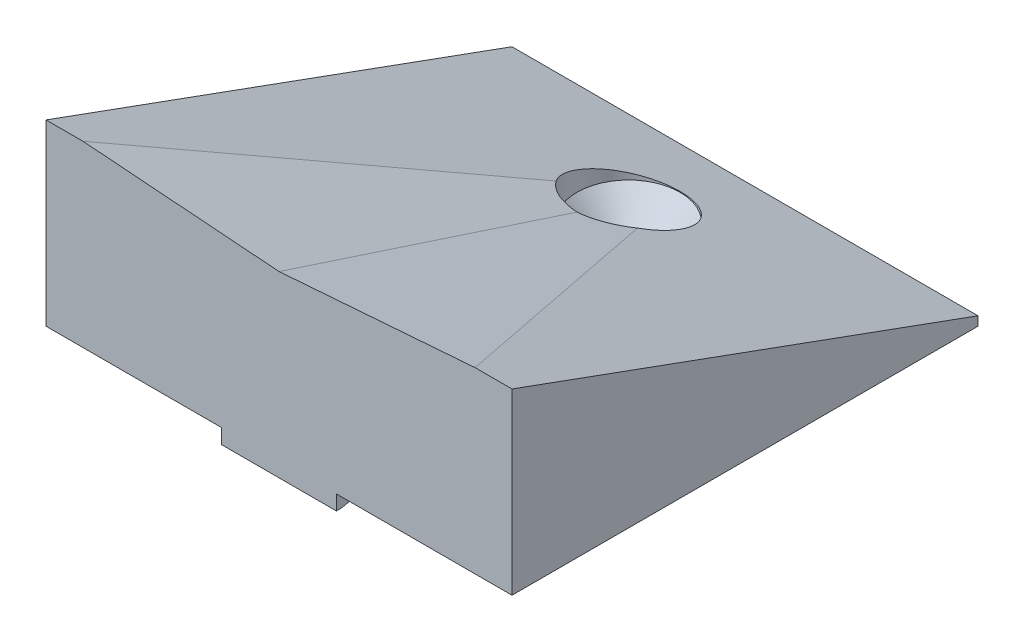
ISO-10303-21;
HEADER;
FILE_DESCRIPTION(('STEP AP214'),'2;1');
FILE_NAME('part.step','',(''),(''),'','','');
FILE_SCHEMA(('AUTOMOTIVE_DESIGN { 1 0 10303 214 1 1 1 1 }'));
ENDSEC;
DATA;
#1=APPLICATION_CONTEXT('core data for automotive mechanical design processes');
#2=APPLICATION_PROTOCOL_DEFINITION('international standard','automotive_design',2000,#1);
#3=PRODUCT_CONTEXT('',#1,'mechanical');
#4=PRODUCT('Part','Part','',(#3));
#5=PRODUCT_RELATED_PRODUCT_CATEGORY('part','',(#4));
#6=PRODUCT_DEFINITION_FORMATION('','',#4);
#7=PRODUCT_DEFINITION_CONTEXT('part definition',#1,'design');
#8=PRODUCT_DEFINITION('design','',#6,#7);
#9=PRODUCT_DEFINITION_SHAPE('','',#8);
#10=(LENGTH_UNIT() NAMED_UNIT(*) SI_UNIT(.MILLI.,.METRE.));
#11=(NAMED_UNIT(*) PLANE_ANGLE_UNIT() SI_UNIT($,.RADIAN.));
#12=(NAMED_UNIT(*) SI_UNIT($,.STERADIAN.) SOLID_ANGLE_UNIT());
#13=UNCERTAINTY_MEASURE_WITH_UNIT(LENGTH_MEASURE(1.E-05),#10,'distance_accuracy_value','');
#14=(GEOMETRIC_REPRESENTATION_CONTEXT(3) GLOBAL_UNCERTAINTY_ASSIGNED_CONTEXT((#13)) GLOBAL_UNIT_ASSIGNED_CONTEXT((#10,
#11,#12)) REPRESENTATION_CONTEXT('',''));
#15=CARTESIAN_POINT('',(0.,0.,0.));
#16=DIRECTION('',(0.,0.,1.));
#17=DIRECTION('',(1.,0.,0.));
#18=AXIS2_PLACEMENT_3D('',#15,#16,#17);
#19=CARTESIAN_POINT('',(16.,0.,0.));
#20=DIRECTION('',(0.,1.,0.));
#21=DIRECTION('',(0.,0.,1.));
#22=AXIS2_PLACEMENT_3D('',#19,#20,#21);
#23=PLANE('',#22);
#24=CARTESIAN_POINT('',(0.,0.,-24.0000000000002));
#25=DIRECTION('',(0.,1.,0.));
#26=DIRECTION('',(0.,0.,1.));
#27=AXIS2_PLACEMENT_3D('',#24,#25,#26);
#28=CIRCLE('',#27,1.89865);
#29=CARTESIAN_POINT('',(0.,0.,-22.1013500000002));
#30=VERTEX_POINT('',#29);
#31=EDGE_CURVE('E203',#30,#30,#28,.T.);
#32=ORIENTED_EDGE('',*,*,#31,.T.);
#33=EDGE_LOOP('',(#32));
#34=FACE_BOUND('',#33,.T.);
#35=CARTESIAN_POINT('',(8.,0.,-16.0000000000002));
#36=DIRECTION('',(0.,1.,0.));
#37=DIRECTION('',(0.,0.,1.));
#38=AXIS2_PLACEMENT_3D('',#35,#36,#37);
#39=CIRCLE('',#38,1.7992);
#40=CARTESIAN_POINT('',(8.,0.,-14.2008000000002));
#41=VERTEX_POINT('',#40);
#42=EDGE_CURVE('E143',#41,#41,#39,.F.);
#43=ORIENTED_EDGE('',*,*,#42,.F.);
#44=EDGE_LOOP('',(#43));
#45=FACE_BOUND('',#44,.T.);
#46=CARTESIAN_POINT('',(0.,0.,-16.0000000000002));
#47=DIRECTION('',(0.,1.,0.));
#48=DIRECTION('',(0.,0.,1.));
#49=AXIS2_PLACEMENT_3D('',#46,#47,#48);
#50=CIRCLE('',#49,3.9492);
#51=CARTESIAN_POINT('',(0.,0.,-12.0508000000002));
#52=VERTEX_POINT('',#51);
#53=EDGE_CURVE('E146',#52,#52,#50,.F.);
#54=ORIENTED_EDGE('',*,*,#53,.F.);
#55=EDGE_LOOP('',(#54));
#56=FACE_BOUND('',#55,.T.);
#57=CARTESIAN_POINT('',(-8.,0.,-16.0000000000002));
#58=DIRECTION('',(0.,1.,0.));
#59=DIRECTION('',(0.,0.,1.));
#60=AXIS2_PLACEMENT_3D('',#57,#58,#59);
#61=CIRCLE('',#60,1.7992);
#62=CARTESIAN_POINT('',(-8.,0.,-14.2008000000002));
#63=VERTEX_POINT('',#62);
#64=EDGE_CURVE('E149',#63,#63,#61,.F.);
#65=ORIENTED_EDGE('',*,*,#64,.F.);
#66=EDGE_LOOP('',(#65));
#67=FACE_BOUND('',#66,.T.);
#68=CARTESIAN_POINT('',(0.,0.,-8.00000000000024));
#69=DIRECTION('',(0.,1.,0.));
#70=DIRECTION('',(0.,0.,1.));
#71=AXIS2_PLACEMENT_3D('',#68,#69,#70);
#72=CIRCLE('',#71,1.7992);
#73=CARTESIAN_POINT('',(0.,0.,-6.20080000000023));
#74=VERTEX_POINT('',#73);
#75=EDGE_CURVE('E152',#74,#74,#72,.F.);
#76=ORIENTED_EDGE('',*,*,#75,.F.);
#77=EDGE_LOOP('',(#76));
#78=FACE_BOUND('',#77,.T.);
#79=CARTESIAN_POINT('',(0.,0.,-2.35922392732846E-13));
#80=DIRECTION('',(0.,-1.,0.));
#81=DIRECTION('',(0.,0.,-1.));
#82=AXIS2_PLACEMENT_3D('',#79,#80,#81);
#83=CIRCLE('',#82,3.9492);
#84=CARTESIAN_POINT('',(-3.9492,0.,0.));
#85=VERTEX_POINT('',#84);
#86=CARTESIAN_POINT('',(3.9492,0.,0.));
#87=VERTEX_POINT('',#86);
#88=EDGE_CURVE('E163',#85,#87,#83,.T.);
#89=ORIENTED_EDGE('',*,*,#88,.F.);
#90=DIRECTION('',(-1.,0.,0.));
#91=VECTOR('',#90,1.);
#92=CARTESIAN_POINT('',(16.,0.,0.));
#93=LINE('',#92,#91);
#94=CARTESIAN_POINT('',(-16.,0.,0.));
#95=VERTEX_POINT('',#94);
#96=EDGE_CURVE('E140',#85,#95,#93,.T.);
#97=ORIENTED_EDGE('',*,*,#96,.T.);
#98=DIRECTION('',(0.,0.,-1.));
#99=VECTOR('',#98,1.);
#100=CARTESIAN_POINT('',(-16.,0.,0.));
#101=LINE('',#100,#99);
#102=CARTESIAN_POINT('',(-16.,0.,-32.));
#103=VERTEX_POINT('',#102);
#104=EDGE_CURVE('E214',#95,#103,#101,.T.);
#105=ORIENTED_EDGE('',*,*,#104,.T.);
#106=DIRECTION('',(-1.,0.,0.));
#107=VECTOR('',#106,1.);
#108=CARTESIAN_POINT('',(16.,0.,-32.));
#109=LINE('',#108,#107);
#110=CARTESIAN_POINT('',(16.,0.,-32.));
#111=VERTEX_POINT('',#110);
#112=EDGE_CURVE('E137',#111,#103,#109,.T.);
#113=ORIENTED_EDGE('',*,*,#112,.F.);
#114=DIRECTION('',(0.,0.,-1.));
#115=VECTOR('',#114,1.);
#116=CARTESIAN_POINT('',(16.,0.,0.));
#117=LINE('',#116,#115);
#118=CARTESIAN_POINT('',(16.,0.,0.));
#119=VERTEX_POINT('',#118);
#120=EDGE_CURVE('E210',#119,#111,#117,.T.);
#121=ORIENTED_EDGE('',*,*,#120,.F.);
#122=EDGE_CURVE('E141',#119,#87,#93,.T.);
#123=ORIENTED_EDGE('',*,*,#122,.T.);
#124=EDGE_LOOP('',(#89,#97,#105,#113,#121,#123));
#125=FACE_BOUND('',#124,.T.);
#126=ADVANCED_FACE('F35',(#34,#45,#56,#67,#78,#125),#23,.F.);
#127=CARTESIAN_POINT('',(16.,0.,0.));
#128=DIRECTION('',(0.,0.,-1.));
#129=DIRECTION('',(-1.,0.,0.));
#130=AXIS2_PLACEMENT_3D('',#127,#128,#129);
#131=PLANE('',#130);
#132=DIRECTION('',(-1.,0.,0.));
#133=VECTOR('',#132,1.);
#134=CARTESIAN_POINT('',(16.,12.2689521596629,0.));
#135=LINE('',#134,#133);
#136=CARTESIAN_POINT('',(16.,12.2689521596629,0.));
#137=VERTEX_POINT('',#136);
#138=CARTESIAN_POINT('',(13.46,12.2689521596629,0.));
#139=VERTEX_POINT('',#138);
#140=EDGE_CURVE('E127',#137,#139,#135,.T.);
#141=ORIENTED_EDGE('',*,*,#140,.T.);
#142=DIRECTION('',(0.99716328124922,0.0752687885400601,0.));
#143=VECTOR('',#142,1.);
#144=CARTESIAN_POINT('',(0.,11.2529521596629,0.));
#145=LINE('',#144,#143);
#146=CARTESIAN_POINT('',(0.,11.2529521596629,0.));
#147=VERTEX_POINT('',#146);
#148=EDGE_CURVE('E121',#147,#139,#145,.T.);
#149=ORIENTED_EDGE('',*,*,#148,.F.);
#150=DIRECTION('',(0.99716328124922,-0.0752687885400601,0.));
#151=VECTOR('',#150,1.);
#152=CARTESIAN_POINT('',(-13.46,12.2689521596629,0.));
#153=LINE('',#152,#151);
#154=CARTESIAN_POINT('',(-13.46,12.2689521596629,0.));
#155=VERTEX_POINT('',#154);
#156=EDGE_CURVE('E110',#155,#147,#153,.T.);
#157=ORIENTED_EDGE('',*,*,#156,.F.);
#158=CARTESIAN_POINT('',(-16.,12.2689521596629,0.));
#159=VERTEX_POINT('',#158);
#160=EDGE_CURVE('E119',#155,#159,#135,.T.);
#161=ORIENTED_EDGE('',*,*,#160,.T.);
#162=DIRECTION('',(0.,-1.,0.));
#163=VECTOR('',#162,1.);
#164=CARTESIAN_POINT('',(-16.,0.,0.));
#165=LINE('',#164,#163);
#166=EDGE_CURVE('E206',#159,#95,#165,.T.);
#167=ORIENTED_EDGE('',*,*,#166,.T.);
#168=ORIENTED_EDGE('',*,*,#96,.F.);
#169=DIRECTION('',(0.,1.,0.));
#170=VECTOR('',#169,1.);
#171=CARTESIAN_POINT('',(-3.9492,-1.016,0.));
#172=LINE('',#171,#170);
#173=CARTESIAN_POINT('',(-3.9492,-1.016,0.));
#174=VERTEX_POINT('',#173);
#175=EDGE_CURVE('E174',#174,#85,#172,.T.);
#176=ORIENTED_EDGE('',*,*,#175,.F.);
#177=DIRECTION('',(-1.,0.,0.));
#178=VECTOR('',#177,1.);
#179=CARTESIAN_POINT('',(3.9492,-1.016,0.));
#180=LINE('',#179,#178);
#181=CARTESIAN_POINT('',(3.9492,-1.016,0.));
#182=VERTEX_POINT('',#181);
#183=EDGE_CURVE('E178',#182,#174,#180,.T.);
#184=ORIENTED_EDGE('',*,*,#183,.F.);
#185=DIRECTION('',(0.,1.,0.));
#186=VECTOR('',#185,1.);
#187=CARTESIAN_POINT('',(3.9492,-1.016,0.));
#188=LINE('',#187,#186);
#189=EDGE_CURVE('E177',#182,#87,#188,.T.);
#190=ORIENTED_EDGE('',*,*,#189,.T.);
#191=ORIENTED_EDGE('',*,*,#122,.F.);
#192=DIRECTION('',(0.,-1.,0.));
#193=VECTOR('',#192,1.);
#194=CARTESIAN_POINT('',(16.,0.,0.));
#195=LINE('',#194,#193);
#196=EDGE_CURVE('E207',#137,#119,#195,.T.);
#197=ORIENTED_EDGE('',*,*,#196,.F.);
#198=EDGE_LOOP('',(#141,#149,#157,#161,#167,#168,#176,#184,#190,#191,#197));
#199=FACE_BOUND('',#198,.T.);
#200=ADVANCED_FACE('F37',(#199),#131,.F.);
#201=CARTESIAN_POINT('',(16.,0.,-32.));
#202=DIRECTION('',(0.,0.,1.));
#203=DIRECTION('',(1.,0.,0.));
#204=AXIS2_PLACEMENT_3D('',#201,#202,#203);
#205=PLANE('',#204);
#206=DIRECTION('',(0.,1.,0.));
#207=VECTOR('',#206,1.);
#208=CARTESIAN_POINT('',(-16.,0.,-32.));
#209=LINE('',#208,#207);
#210=CARTESIAN_POINT('',(-16.,0.621904663144418,-32.));
#211=VERTEX_POINT('',#210);
#212=EDGE_CURVE('E215',#103,#211,#209,.T.);
#213=ORIENTED_EDGE('',*,*,#212,.T.);
#214=DIRECTION('',(-1.,0.,0.));
#215=VECTOR('',#214,1.);
#216=CARTESIAN_POINT('',(16.,0.621904663144418,-32.));
#217=LINE('',#216,#215);
#218=CARTESIAN_POINT('',(16.,0.621904663144418,-32.));
#219=VERTEX_POINT('',#218);
#220=EDGE_CURVE('E130',#219,#211,#217,.T.);
#221=ORIENTED_EDGE('',*,*,#220,.F.);
#222=DIRECTION('',(0.,1.,0.));
#223=VECTOR('',#222,1.);
#224=CARTESIAN_POINT('',(16.,0.,-32.));
#225=LINE('',#224,#223);
#226=EDGE_CURVE('E131',#111,#219,#225,.T.);
#227=ORIENTED_EDGE('',*,*,#226,.F.);
#228=ORIENTED_EDGE('',*,*,#112,.T.);
#229=EDGE_LOOP('',(#213,#221,#227,#228));
#230=FACE_BOUND('',#229,.T.);
#231=ADVANCED_FACE('F220',(#230),#205,.F.);
#232=CARTESIAN_POINT('',(16.,12.2689521596629,0.));
#233=DIRECTION('',(0.,-0.939692620785908,0.342020143325669));
#234=DIRECTION('',(0.,-0.342020143325669,-0.939692620785908));
#235=AXIS2_PLACEMENT_3D('',#232,#233,#234);
#236=PLANE('',#235);
#237=CARTESIAN_POINT('',(0.,3.53366653727396,-24.0000000000002));
#238=DIRECTION('',(0.,-0.939692620785908,0.342020143325669));
#239=DIRECTION('',(0.,-0.342020143325669,-0.939692620785908));
#240=AXIS2_PLACEMENT_3D('',#237,#238,#239);
#241=ELLIPSE('',#240,3.7707011012139,3.5433);
#242=CARTESIAN_POINT('',(2.36431938921888E-13,2.24401080619852,-27.5433000000002));
#243=VERTEX_POINT('',#242);
#244=CARTESIAN_POINT('',(2.79551104562542,4.3260935911434,-21.822824562929));
#245=VERTEX_POINT('',#244);
#246=EDGE_CURVE('E198',#243,#245,#241,.T.);
#247=ORIENTED_EDGE('',*,*,#246,.T.);
#248=DIRECTION('',(0.417315808976742,0.310814748206935,0.853956502332026));
#249=VECTOR('',#248,1.);
#250=CARTESIAN_POINT('',(13.9023473104317,12.5984102462112,0.905178653448149));
#251=LINE('',#250,#249);
#252=EDGE_CURVE('E114',#245,#139,#251,.T.);
#253=ORIENTED_EDGE('',*,*,#252,.T.);
#254=ORIENTED_EDGE('',*,*,#140,.F.);
#255=DIRECTION('',(0.,0.342020143325669,0.939692620785908));
#256=VECTOR('',#255,1.);
#257=CARTESIAN_POINT('',(16.,2.19207225376882,-27.686));
#258=LINE('',#257,#256);
#259=EDGE_CURVE('E128',#219,#137,#258,.T.);
#260=ORIENTED_EDGE('',*,*,#259,.F.);
#261=ORIENTED_EDGE('',*,*,#220,.T.);
#262=DIRECTION('',(0.,0.342020143325669,0.939692620785908));
#263=VECTOR('',#262,1.);
#264=CARTESIAN_POINT('',(-16.,12.2689521596629,0.));
#265=LINE('',#264,#263);
#266=EDGE_CURVE('E125',#211,#159,#265,.T.);
#267=ORIENTED_EDGE('',*,*,#266,.T.);
#268=ORIENTED_EDGE('',*,*,#160,.F.);
#269=DIRECTION('',(0.417315808976742,-0.310814748206935,-0.853956502332026));
#270=VECTOR('',#269,1.);
#271=CARTESIAN_POINT('',(-8.32946780893048,8.44775718733507,-10.4986469018043));
#272=LINE('',#271,#270);
#273=CARTESIAN_POINT('',(-2.79551104562537,4.32609359114342,-21.8228245629289));
#274=VERTEX_POINT('',#273);
#275=EDGE_CURVE('E107',#155,#274,#272,.T.);
#276=ORIENTED_EDGE('',*,*,#275,.T.);
#277=EDGE_CURVE('E57',#274,#243,#241,.T.);
#278=ORIENTED_EDGE('',*,*,#277,.T.);
#279=EDGE_LOOP('',(#247,#253,#254,#260,#261,#267,#268,#276,#278));
#280=FACE_BOUND('',#279,.T.);
#281=ADVANCED_FACE('F123',(#280),#236,.F.);
#282=CARTESIAN_POINT('',(16.,0.,0.));
#283=DIRECTION('',(-1.,0.,0.));
#284=DIRECTION('',(0.,0.,1.));
#285=AXIS2_PLACEMENT_3D('',#282,#283,#284);
#286=PLANE('',#285);
#287=ORIENTED_EDGE('',*,*,#259,.T.);
#288=ORIENTED_EDGE('',*,*,#196,.T.);
#289=ORIENTED_EDGE('',*,*,#120,.T.);
#290=ORIENTED_EDGE('',*,*,#226,.T.);
#291=EDGE_LOOP('',(#287,#288,#289,#290));
#292=FACE_BOUND('',#291,.T.);
#293=ADVANCED_FACE('F229',(#292),#286,.F.);
#294=CARTESIAN_POINT('',(-16.,0.,0.));
#295=DIRECTION('',(-1.,0.,0.));
#296=DIRECTION('',(0.,0.,1.));
#297=AXIS2_PLACEMENT_3D('',#294,#295,#296);
#298=PLANE('',#297);
#299=ORIENTED_EDGE('',*,*,#266,.F.);
#300=ORIENTED_EDGE('',*,*,#212,.F.);
#301=ORIENTED_EDGE('',*,*,#104,.F.);
#302=ORIENTED_EDGE('',*,*,#166,.F.);
#303=EDGE_LOOP('',(#299,#300,#301,#302));
#304=FACE_BOUND('',#303,.T.);
#305=ADVANCED_FACE('F230',(#304),#298,.T.);
#306=CARTESIAN_POINT('',(0.,2.19207225376882,-24.0000000000002));
#307=DIRECTION('',(0.,1.,0.));
#308=DIRECTION('',(0.,0.,1.));
#309=AXIS2_PLACEMENT_3D('',#306,#307,#308);
#310=CYLINDRICAL_SURFACE('',#309,1.89865);
#311=ORIENTED_EDGE('',*,*,#31,.F.);
#312=EDGE_LOOP('',(#311));
#313=FACE_BOUND('',#312,.T.);
#314=CARTESIAN_POINT('',(0.,0.300118852832786,-24.0000000000002));
#315=DIRECTION('',(0.,1.,0.));
#316=DIRECTION('',(0.,0.,1.));
#317=AXIS2_PLACEMENT_3D('',#314,#315,#316);
#318=CIRCLE('',#317,1.89865);
#319=CARTESIAN_POINT('',(0.,0.300118852832786,-22.1013500000002));
#320=VERTEX_POINT('',#319);
#321=EDGE_CURVE('E200',#320,#320,#318,.T.);
#322=ORIENTED_EDGE('',*,*,#321,.T.);
#323=EDGE_LOOP('',(#322));
#324=FACE_BOUND('',#323,.T.);
#325=ADVANCED_FACE('F232',(#313,#324),#310,.F.);
#326=CARTESIAN_POINT('',(0.,2.19207225376882,-24.0000000000002));
#327=DIRECTION('',(0.,1.,0.));
#328=DIRECTION('',(0.,0.,1.));
#329=AXIS2_PLACEMENT_3D('',#326,#327,#328);
#330=CONICAL_SURFACE('',#329,3.5433,0.715584993317675);
#331=ORIENTED_EDGE('',*,*,#321,.F.);
#332=EDGE_LOOP('',(#331));
#333=FACE_BOUND('',#332,.T.);
#334=CARTESIAN_POINT('',(0.,2.19207225376882,-24.0000000000002));
#335=DIRECTION('',(0.,1.,0.));
#336=DIRECTION('',(0.,0.,1.));
#337=AXIS2_PLACEMENT_3D('',#334,#335,#336);
#338=CIRCLE('',#337,3.5433);
#339=CARTESIAN_POINT('',(0.,2.19207225376882,-20.4567000000002));
#340=VERTEX_POINT('',#339);
#341=EDGE_CURVE('E195',#340,#340,#338,.T.);
#342=ORIENTED_EDGE('',*,*,#341,.T.);
#343=EDGE_LOOP('',(#342));
#344=FACE_BOUND('',#343,.T.);
#345=ADVANCED_FACE('F238',(#333,#344),#330,.F.);
#346=CARTESIAN_POINT('',(0.,37.6387234721283,-24.0000000000002));
#347=DIRECTION('',(0.,-1.,0.));
#348=DIRECTION('',(0.,0.,-1.));
#349=AXIS2_PLACEMENT_3D('',#346,#347,#348);
#350=CYLINDRICAL_SURFACE('',#349,3.5433);
#351=CARTESIAN_POINT('',(0.,3.40296350604678,-24.0000000000002));
#352=DIRECTION('',(0.0715588475706462,-0.94801386643789,0.310079087292006));
#353=DIRECTION('',(-0.213175969326705,-0.318229019797821,-0.923734971222881));
#354=AXIS2_PLACEMENT_3D('',#351,#352,#353);
#355=ELLIPSE('',#354,3.7376035577557,3.5433);
#356=CARTESIAN_POINT('',(0.,4.56191620589502,-20.4567000000002));
#357=VERTEX_POINT('',#356);
#358=EDGE_CURVE('E11',#245,#357,#355,.T.);
#359=ORIENTED_EDGE('',*,*,#358,.F.);
#360=ORIENTED_EDGE('',*,*,#246,.F.);
#361=ORIENTED_EDGE('',*,*,#277,.F.);
#362=CARTESIAN_POINT('',(0.,3.40296350604678,-24.0000000000002));
#363=DIRECTION('',(-0.0715588475706462,-0.94801386643789,0.310079087292006));
#364=DIRECTION('',(0.213175969326705,-0.318229019797821,-0.923734971222881));
#365=AXIS2_PLACEMENT_3D('',#362,#363,#364);
#366=ELLIPSE('',#365,3.7376035577557,3.5433);
#367=EDGE_CURVE('E43',#357,#274,#366,.T.);
#368=ORIENTED_EDGE('',*,*,#367,.F.);
#369=EDGE_LOOP('',(#359,#360,#361,#368));
#370=FACE_BOUND('',#369,.T.);
#371=ORIENTED_EDGE('',*,*,#341,.F.);
#372=EDGE_LOOP('',(#371));
#373=FACE_BOUND('',#372,.T.);
#374=ADVANCED_FACE('F272',(#370,#373),#350,.F.);
#375=CARTESIAN_POINT('',(8.,-1.016,-16.0000000000002));
#376=DIRECTION('',(0.,1.,0.));
#377=DIRECTION('',(0.,0.,1.));
#378=AXIS2_PLACEMENT_3D('',#375,#376,#377);
#379=CYLINDRICAL_SURFACE('',#378,1.7992);
#380=CARTESIAN_POINT('',(8.,-1.016,-16.0000000000002));
#381=DIRECTION('',(0.,-1.,0.));
#382=DIRECTION('',(0.,0.,-1.));
#383=AXIS2_PLACEMENT_3D('',#380,#381,#382);
#384=CIRCLE('',#383,1.7992);
#385=CARTESIAN_POINT('',(8.,-1.016,-17.7992000000002));
#386=VERTEX_POINT('',#385);
#387=EDGE_CURVE('E192',#386,#386,#384,.T.);
#388=ORIENTED_EDGE('',*,*,#387,.F.);
#389=EDGE_LOOP('',(#388));
#390=FACE_BOUND('',#389,.T.);
#391=ORIENTED_EDGE('',*,*,#42,.T.);
#392=EDGE_LOOP('',(#391));
#393=FACE_BOUND('',#392,.T.);
#394=ADVANCED_FACE('F266',(#390,#393),#379,.T.);
#395=CARTESIAN_POINT('',(8.,-1.016,-16.0000000000002));
#396=DIRECTION('',(0.,-1.,0.));
#397=DIRECTION('',(0.,0.,-1.));
#398=AXIS2_PLACEMENT_3D('',#395,#396,#397);
#399=PLANE('',#398);
#400=ORIENTED_EDGE('',*,*,#387,.T.);
#401=EDGE_LOOP('',(#400));
#402=FACE_BOUND('',#401,.T.);
#403=ADVANCED_FACE('F271',(#402),#399,.T.);
#404=CARTESIAN_POINT('',(0.,-1.016,-16.0000000000002));
#405=DIRECTION('',(0.,1.,0.));
#406=DIRECTION('',(0.,0.,1.));
#407=AXIS2_PLACEMENT_3D('',#404,#405,#406);
#408=CYLINDRICAL_SURFACE('',#407,3.9492);
#409=CARTESIAN_POINT('',(0.,-1.016,-16.0000000000002));
#410=DIRECTION('',(0.,-1.,0.));
#411=DIRECTION('',(0.,0.,-1.));
#412=AXIS2_PLACEMENT_3D('',#409,#410,#411);
#413=CIRCLE('',#412,3.9492);
#414=CARTESIAN_POINT('',(0.,-1.016,-19.9492000000002));
#415=VERTEX_POINT('',#414);
#416=EDGE_CURVE('E189',#415,#415,#413,.T.);
#417=ORIENTED_EDGE('',*,*,#416,.F.);
#418=EDGE_LOOP('',(#417));
#419=FACE_BOUND('',#418,.T.);
#420=ORIENTED_EDGE('',*,*,#53,.T.);
#421=EDGE_LOOP('',(#420));
#422=FACE_BOUND('',#421,.T.);
#423=ADVANCED_FACE('F283',(#419,#422),#408,.T.);
#424=CARTESIAN_POINT('',(0.,-1.016,-16.0000000000002));
#425=DIRECTION('',(0.,-1.,0.));
#426=DIRECTION('',(0.,0.,-1.));
#427=AXIS2_PLACEMENT_3D('',#424,#425,#426);
#428=PLANE('',#427);
#429=ORIENTED_EDGE('',*,*,#416,.T.);
#430=EDGE_LOOP('',(#429));
#431=FACE_BOUND('',#430,.T.);
#432=ADVANCED_FACE('F293',(#431),#428,.T.);
#433=CARTESIAN_POINT('',(-8.,-1.016,-16.0000000000002));
#434=DIRECTION('',(0.,1.,0.));
#435=DIRECTION('',(0.,0.,1.));
#436=AXIS2_PLACEMENT_3D('',#433,#434,#435);
#437=CYLINDRICAL_SURFACE('',#436,1.7992);
#438=CARTESIAN_POINT('',(-8.,-1.016,-16.0000000000002));
#439=DIRECTION('',(0.,-1.,0.));
#440=DIRECTION('',(0.,0.,-1.));
#441=AXIS2_PLACEMENT_3D('',#438,#439,#440);
#442=CIRCLE('',#441,1.7992);
#443=CARTESIAN_POINT('',(-8.,-1.016,-17.7992000000002));
#444=VERTEX_POINT('',#443);
#445=EDGE_CURVE('E186',#444,#444,#442,.T.);
#446=ORIENTED_EDGE('',*,*,#445,.F.);
#447=EDGE_LOOP('',(#446));
#448=FACE_BOUND('',#447,.T.);
#449=ORIENTED_EDGE('',*,*,#64,.T.);
#450=EDGE_LOOP('',(#449));
#451=FACE_BOUND('',#450,.T.);
#452=ADVANCED_FACE('F303',(#448,#451),#437,.T.);
#453=CARTESIAN_POINT('',(-8.,-1.016,-16.0000000000002));
#454=DIRECTION('',(0.,-1.,0.));
#455=DIRECTION('',(0.,0.,-1.));
#456=AXIS2_PLACEMENT_3D('',#453,#454,#455);
#457=PLANE('',#456);
#458=ORIENTED_EDGE('',*,*,#445,.T.);
#459=EDGE_LOOP('',(#458));
#460=FACE_BOUND('',#459,.T.);
#461=ADVANCED_FACE('F313',(#460),#457,.T.);
#462=CARTESIAN_POINT('',(0.,-1.016,-8.00000000000024));
#463=DIRECTION('',(0.,1.,0.));
#464=DIRECTION('',(0.,0.,1.));
#465=AXIS2_PLACEMENT_3D('',#462,#463,#464);
#466=CYLINDRICAL_SURFACE('',#465,1.7992);
#467=CARTESIAN_POINT('',(0.,-1.016,-8.00000000000024));
#468=DIRECTION('',(0.,-1.,0.));
#469=DIRECTION('',(0.,0.,-1.));
#470=AXIS2_PLACEMENT_3D('',#467,#468,#469);
#471=CIRCLE('',#470,1.7992);
#472=CARTESIAN_POINT('',(0.,-1.016,-9.79920000000024));
#473=VERTEX_POINT('',#472);
#474=EDGE_CURVE('E180',#473,#473,#471,.T.);
#475=ORIENTED_EDGE('',*,*,#474,.F.);
#476=EDGE_LOOP('',(#475));
#477=FACE_BOUND('',#476,.T.);
#478=ORIENTED_EDGE('',*,*,#75,.T.);
#479=EDGE_LOOP('',(#478));
#480=FACE_BOUND('',#479,.T.);
#481=ADVANCED_FACE('F156',(#477,#480),#466,.T.);
#482=CARTESIAN_POINT('',(0.,-1.016,-8.00000000000024));
#483=DIRECTION('',(0.,-1.,0.));
#484=DIRECTION('',(0.,0.,-1.));
#485=AXIS2_PLACEMENT_3D('',#482,#483,#484);
#486=PLANE('',#485);
#487=ORIENTED_EDGE('',*,*,#474,.T.);
#488=EDGE_LOOP('',(#487));
#489=FACE_BOUND('',#488,.T.);
#490=ADVANCED_FACE('F332',(#489),#486,.T.);
#491=CARTESIAN_POINT('',(0.,-1.016,-2.35922392732846E-13));
#492=DIRECTION('',(0.,1.,0.));
#493=DIRECTION('',(0.,0.,1.));
#494=AXIS2_PLACEMENT_3D('',#491,#492,#493);
#495=CYLINDRICAL_SURFACE('',#494,3.9492);
#496=ORIENTED_EDGE('',*,*,#88,.T.);
#497=ORIENTED_EDGE('',*,*,#189,.F.);
#498=CARTESIAN_POINT('',(0.,-1.016,-2.35922392732846E-13));
#499=DIRECTION('',(0.,-1.,0.));
#500=DIRECTION('',(0.,0.,-1.));
#501=AXIS2_PLACEMENT_3D('',#498,#499,#500);
#502=CIRCLE('',#501,3.9492);
#503=EDGE_CURVE('E170',#174,#182,#502,.T.);
#504=ORIENTED_EDGE('',*,*,#503,.F.);
#505=ORIENTED_EDGE('',*,*,#175,.T.);
#506=EDGE_LOOP('',(#496,#497,#504,#505));
#507=FACE_BOUND('',#506,.T.);
#508=ADVANCED_FACE('F175',(#507),#495,.T.);
#509=CARTESIAN_POINT('',(0.,-1.016,-2.35922392732846E-13));
#510=DIRECTION('',(0.,-1.,0.));
#511=DIRECTION('',(0.,0.,-1.));
#512=AXIS2_PLACEMENT_3D('',#509,#510,#511);
#513=PLANE('',#512);
#514=ORIENTED_EDGE('',*,*,#503,.T.);
#515=ORIENTED_EDGE('',*,*,#183,.T.);
#516=EDGE_LOOP('',(#514,#515));
#517=FACE_BOUND('',#516,.T.);
#518=ADVANCED_FACE('F350',(#517),#513,.T.);
#519=CARTESIAN_POINT('',(0.,0.513928996413471,-32.8327297389483));
#520=DIRECTION('',(0.0715588475706462,-0.94801386643789,0.310079087292006));
#521=DIRECTION('',(0.,-0.310876055492105,-0.950450460635203));
#522=AXIS2_PLACEMENT_3D('',#519,#520,#521);
#523=PLANE('',#522);
#524=ORIENTED_EDGE('',*,*,#358,.T.);
#525=DIRECTION('',(0.,0.310876055492105,0.950450460635203));
#526=VECTOR('',#525,1.);
#527=CARTESIAN_POINT('',(0.,0.513928996413471,-32.8327297389483));
#528=LINE('',#527,#526);
#529=EDGE_CURVE('E50',#357,#147,#528,.T.);
#530=ORIENTED_EDGE('',*,*,#529,.T.);
#531=ORIENTED_EDGE('',*,*,#148,.T.);
#532=ORIENTED_EDGE('',*,*,#252,.F.);
#533=EDGE_LOOP('',(#524,#530,#531,#532));
#534=FACE_BOUND('',#533,.T.);
#535=ADVANCED_FACE('F358',(#534),#523,.F.);
#536=CARTESIAN_POINT('',(-13.46,1.52992899641347,-32.8327297389483));
#537=DIRECTION('',(-0.0715588475706462,-0.94801386643789,0.310079087292006));
#538=DIRECTION('',(0.,-0.310876055492105,-0.950450460635203));
#539=AXIS2_PLACEMENT_3D('',#536,#537,#538);
#540=PLANE('',#539);
#541=ORIENTED_EDGE('',*,*,#156,.T.);
#542=ORIENTED_EDGE('',*,*,#529,.F.);
#543=ORIENTED_EDGE('',*,*,#367,.T.);
#544=ORIENTED_EDGE('',*,*,#275,.F.);
#545=EDGE_LOOP('',(#541,#542,#543,#544));
#546=FACE_BOUND('',#545,.T.);
#547=ADVANCED_FACE('F109',(#546),#540,.F.);
#548=CLOSED_SHELL('',(#126,#200,#231,#281,#293,#305,#325,#345,#374,#394,#403,#423,#432,#452,
#461,#481,#490,#508,#518,#535,#547));
#549=MANIFOLD_SOLID_BREP('B2',#548);
#550=ADVANCED_BREP_SHAPE_REPRESENTATION('',(#18,#549),#14);
#551=SHAPE_DEFINITION_REPRESENTATION(#9,#550);
ENDSEC;
END-ISO-10303-21;
